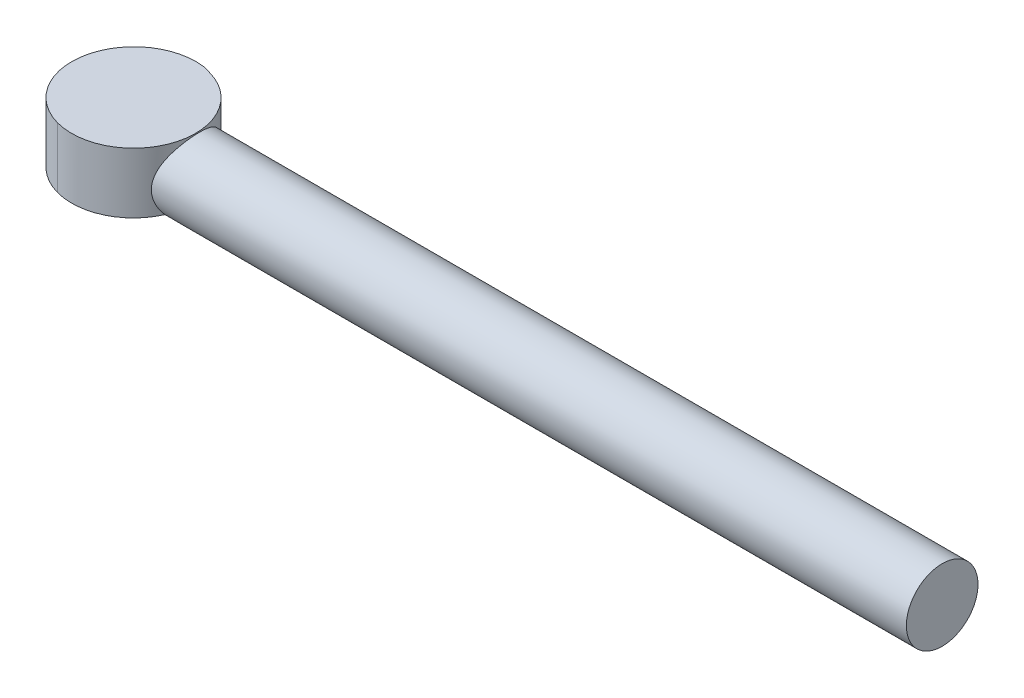
ISO-10303-21;
HEADER;
FILE_DESCRIPTION(('STEP AP214'),'2;1');
FILE_NAME('part.step','',(''),(''),'','','');
FILE_SCHEMA(('AUTOMOTIVE_DESIGN { 1 0 10303 214 1 1 1 1 }'));
ENDSEC;
DATA;
#1=APPLICATION_CONTEXT('core data for automotive mechanical design processes');
#2=APPLICATION_PROTOCOL_DEFINITION('international standard','automotive_design',2000,#1);
#3=PRODUCT_CONTEXT('',#1,'mechanical');
#4=PRODUCT('Part','Part','',(#3));
#5=PRODUCT_RELATED_PRODUCT_CATEGORY('part','',(#4));
#6=PRODUCT_DEFINITION_FORMATION('','',#4);
#7=PRODUCT_DEFINITION_CONTEXT('part definition',#1,'design');
#8=PRODUCT_DEFINITION('design','',#6,#7);
#9=PRODUCT_DEFINITION_SHAPE('','',#8);
#10=(LENGTH_UNIT() NAMED_UNIT(*) SI_UNIT(.MILLI.,.METRE.));
#11=(NAMED_UNIT(*) PLANE_ANGLE_UNIT() SI_UNIT($,.RADIAN.));
#12=(NAMED_UNIT(*) SI_UNIT($,.STERADIAN.) SOLID_ANGLE_UNIT());
#13=UNCERTAINTY_MEASURE_WITH_UNIT(LENGTH_MEASURE(1.E-05),#10,'distance_accuracy_value','');
#14=(GEOMETRIC_REPRESENTATION_CONTEXT(3) GLOBAL_UNCERTAINTY_ASSIGNED_CONTEXT((#13)) GLOBAL_UNIT_ASSIGNED_CONTEXT((#10,
#11,#12)) REPRESENTATION_CONTEXT('',''));
#15=CARTESIAN_POINT('',(0.,0.,0.));
#16=DIRECTION('',(0.,0.,1.));
#17=DIRECTION('',(1.,0.,0.));
#18=AXIS2_PLACEMENT_3D('',#15,#16,#17);
#19=CARTESIAN_POINT('',(96.8545760170194,56.3914355366215,55.1659043838348));
#20=DIRECTION('',(0.,-1.,0.));
#21=DIRECTION('',(0.,0.,-1.));
#22=AXIS2_PLACEMENT_3D('',#19,#20,#21);
#23=PLANE('',#22);
#24=CARTESIAN_POINT('',(96.8541225803506,56.3914355366215,55.167567362771));
#25=DIRECTION('',(0.,1.,0.));
#26=DIRECTION('',(0.,0.,1.));
#27=AXIS2_PLACEMENT_3D('',#24,#25,#26);
#28=CIRCLE('',#27,0.00172368899597669);
#29=CARTESIAN_POINT('',(96.8541225803506,56.3914355366215,55.169291051767));
#30=VERTEX_POINT('',#29);
#31=EDGE_CURVE('E248',#30,#30,#28,.T.);
#32=ORIENTED_EDGE('',*,*,#31,.F.);
#33=EDGE_LOOP('',(#32));
#34=FACE_BOUND('',#33,.T.);
#35=ADVANCED_FACE('F49',(#34),#23,.T.);
#36=CARTESIAN_POINT('',(96.8545760170194,56.3914355366215,55.1659043838348));
#37=DIRECTION('',(0.,-1.,0.));
#38=DIRECTION('',(0.,0.,-1.));
#39=AXIS2_PLACEMENT_3D('',#36,#37,#38);
#40=CYLINDRICAL_SURFACE('',#39,3.46216045673487);
#41=CARTESIAN_POINT('',(96.8545760170194,56.3914355366215,55.1659043838348));
#42=DIRECTION('',(0.,-1.,0.));
#43=DIRECTION('',(0.,0.,-1.));
#44=AXIS2_PLACEMENT_3D('',#41,#42,#43);
#45=CIRCLE('',#44,3.46216045673487);
#46=CARTESIAN_POINT('',(97.7653380559085,56.3914355366215,51.8256846999372));
#47=VERTEX_POINT('',#46);
#48=EDGE_CURVE('E183',#47,#47,#45,.T.);
#49=ORIENTED_EDGE('',*,*,#48,.F.);
#50=EDGE_LOOP('',(#49));
#51=FACE_BOUND('',#50,.T.);
#52=CARTESIAN_POINT('',(96.8541225803506,52.7701991631346,58.6314515085018));
#53=CARTESIAN_POINT('',(96.9112620064534,52.7701991631346,58.6314559256041));
#54=CARTESIAN_POINT('',(96.9684043444901,52.7701991631346,58.6300902903348));
#55=CARTESIAN_POINT('',(97.0821485067964,52.7701991631346,58.6245925534005));
#56=CARTESIAN_POINT('',(97.1387512876547,52.7701991631346,58.6204801677707));
#57=CARTESIAN_POINT('',(97.2514170575452,52.7701991631346,58.6094899818808));
#58=CARTESIAN_POINT('',(97.3074813334975,52.7701991631346,58.6026254247951));
#59=CARTESIAN_POINT('',(97.419069435874,52.7701991631346,58.5861389727258));
#60=CARTESIAN_POINT('',(97.4745942184117,52.7701991631346,58.5765235519419));
#61=CARTESIAN_POINT('',(97.5851038909195,52.7701991631346,58.5545418339806));
#62=CARTESIAN_POINT('',(97.6400887116757,52.7701991631346,58.5421751888272));
#63=CARTESIAN_POINT('',(97.7495196178963,52.7701991631346,58.5146981423592));
#64=CARTESIAN_POINT('',(97.8039639377698,52.7701991631346,58.4995807130437));
#65=CARTESIAN_POINT('',(97.9123155402251,52.7701991631346,58.4666081294795));
#66=CARTESIAN_POINT('',(97.9662187495785,52.7701991631346,58.4487396002146));
#67=CARTESIAN_POINT('',(98.0734910305163,52.7701991631346,58.4102732973724));
#68=CARTESIAN_POINT('',(98.1268532093883,52.7701991631346,58.3896563274302));
#69=CARTESIAN_POINT('',(98.2324667465263,52.7701991631346,58.3459296145232));
#70=CARTESIAN_POINT('',(98.2847194340027,52.7701991631346,58.3228230824743));
#71=CARTESIAN_POINT('',(98.3876711797754,52.7701991631346,58.2742500509742));
#72=CARTESIAN_POINT('',(98.4383785460453,52.7701991631346,58.24880118052));
#73=CARTESIAN_POINT('',(98.538241782558,52.7701991631346,58.195551838598));
#74=CARTESIAN_POINT('',(98.5874037577123,52.7701991631346,58.1677628209074));
#75=CARTESIAN_POINT('',(98.684178445602,52.7701991631346,58.1098388910631));
#76=CARTESIAN_POINT('',(98.7317943442887,52.7701991631346,58.079709303126));
#77=CARTESIAN_POINT('',(98.8254799571681,52.7701991631346,58.0171105292722));
#78=CARTESIAN_POINT('',(98.8715492771248,52.7701991631346,57.9846407533606));
#79=CARTESIAN_POINT('',(98.9621455510482,52.7701991631346,57.9173676187104));
#80=CARTESIAN_POINT('',(99.0066679689467,52.7701991631346,57.8825581528587));
#81=CARTESIAN_POINT('',(99.094174251266,52.7701991631346,57.8106105023401));
#82=CARTESIAN_POINT('',(99.1371490051695,52.7701991631346,57.7734612419675));
#83=CARTESIAN_POINT('',(99.2215662186495,52.7701991631346,57.6968410350278));
#84=CARTESIAN_POINT('',(99.2629947305358,52.7701991631346,57.6573547345584));
#85=CARTESIAN_POINT('',(99.3438528381099,52.7701991631346,57.5765214364688));
#86=CARTESIAN_POINT('',(99.3832857462363,52.7701991631346,57.5351777526927));
#87=CARTESIAN_POINT('',(99.4598128126185,52.7701991631346,57.4509043452251));
#88=CARTESIAN_POINT('',(99.4969213945965,52.7701991631346,57.4079877311046));
#89=CARTESIAN_POINT('',(99.5688053140424,52.7701991631346,57.3205757081029));
#90=CARTESIAN_POINT('',(99.6035906745621,52.7701991631346,57.2760885445628));
#91=CARTESIAN_POINT('',(99.6708323103181,52.7701991631346,57.1855397522172));
#92=CARTESIAN_POINT('',(99.70329356652,52.7701991631346,57.1394818231766));
#93=CARTESIAN_POINT('',(99.7658922702614,52.7701991631346,57.0457961625126));
#94=CARTESIAN_POINT('',(99.7960291277943,52.7701991631346,56.998168036674));
#95=CARTESIAN_POINT('',(99.8539848576856,52.7701991631346,56.9013460721814));
#96=CARTESIAN_POINT('',(99.8817972021687,52.7701991631346,56.8521483271651));
#97=CARTESIAN_POINT('',(99.9351092913124,52.7701991631346,56.7521901607608));
#98=CARTESIAN_POINT('',(99.960596380465,52.7701991631346,56.701422993201));
#99=CARTESIAN_POINT('',(100.009266432467,52.7701991631346,56.5983300832824));
#100=CARTESIAN_POINT('',(100.032430633645,52.7701991631346,56.5459954933168));
#101=CARTESIAN_POINT('',(100.076200220294,52.7701991631346,56.4403722055096));
#102=CARTESIAN_POINT('',(100.096809934211,52.7701991631346,56.3870853016451));
#103=CARTESIAN_POINT('',(100.135261687702,52.7701991631346,56.2799411849219));
#104=CARTESIAN_POINT('',(100.153122069873,52.7701991631346,56.2260905640079));
#105=CARTESIAN_POINT('',(100.186083018773,52.7701991631346,56.117823600034));
#106=CARTESIAN_POINT('',(100.201196000949,52.7701991631346,56.0634110390203));
#107=CARTESIAN_POINT('',(100.228667649306,52.7701991631346,55.9540226031096));
#108=CARTESIAN_POINT('',(100.241032333137,52.7701991631346,55.8990482402167));
#109=CARTESIAN_POINT('',(100.263014044099,52.7701991631346,55.7885384890301));
#110=CARTESIAN_POINT('',(100.272630375275,52.7701991631346,55.7330029623146));
#111=CARTESIAN_POINT('',(100.289122326213,52.7701991631346,55.6213724333826));
#112=CARTESIAN_POINT('',(100.295990420104,52.7701991631346,55.5652763202677));
#113=CARTESIAN_POINT('',(100.306992033887,52.7701991631346,55.45252536296));
#114=CARTESIAN_POINT('',(100.311111279965,52.7701991631346,55.3958691291704));
#115=CARTESIAN_POINT('',(100.316624596235,52.7701991631346,55.2819984771971));
#116=CARTESIAN_POINT('',(100.317997947072,52.7701991631346,55.224783064671));
#117=CARTESIAN_POINT('',(100.318015490006,52.7701991631346,55.1104499752584));
#118=CARTESIAN_POINT('',(100.316664367594,52.7701991631346,55.0533322993655));
#119=CARTESIAN_POINT('',(100.311186877288,52.7701991631346,54.93962919389));
#120=CARTESIAN_POINT('',(100.307079978372,52.7701991631346,54.8830428350618));
#121=CARTESIAN_POINT('',(100.296099951048,52.7701991631346,54.7704035939406));
#122=CARTESIAN_POINT('',(100.289239740342,52.7701991631346,54.7143494546163));
#123=CARTESIAN_POINT('',(100.272759091868,52.7701991631346,54.6027747728993));
#124=CARTESIAN_POINT('',(100.263144792302,52.7701991631346,54.5472533245609));
#125=CARTESIAN_POINT('',(100.241162994256,52.7701991631346,54.4367435906964));
#126=CARTESIAN_POINT('',(100.228794799825,52.7701991631346,54.3817554436156));
#127=CARTESIAN_POINT('',(100.20131222178,52.7701991631346,54.2723110863405));
#128=CARTESIAN_POINT('',(100.186190460044,52.7701991631346,54.2178567298359));
#129=CARTESIAN_POINT('',(100.153206702498,52.7701991631346,54.1094782927842));
#130=CARTESIAN_POINT('',(100.135330987627,52.7701991631346,54.0555583907687));
#131=CARTESIAN_POINT('',(100.096848215743,52.7701991631346,53.9482457712625));
#132=CARTESIAN_POINT('',(100.076221636022,52.7701991631346,53.8948600640733));
#133=CARTESIAN_POINT('',(100.032484464492,52.7701991631346,53.7892233494854));
#134=CARTESIAN_POINT('',(100.00937820189,52.7701991631346,53.7369705499456));
#135=CARTESIAN_POINT('',(99.960805366033,52.7701991631346,53.6340187228048));
#136=CARTESIAN_POINT('',(99.9353564241618,52.7701991631346,53.5833113862374));
#137=CARTESIAN_POINT('',(99.8821070302389,52.7701991631346,53.483448171352));
#138=CARTESIAN_POINT('',(99.854318031545,52.7701991631346,53.4342861882971));
#139=CARTESIAN_POINT('',(99.7963941155727,52.7701991631346,53.337511494638));
#140=CARTESIAN_POINT('',(99.7662645225642,52.7701991631346,53.2898955980605));
#141=CARTESIAN_POINT('',(99.7036657449962,52.7701991631346,53.1962099867259));
#142=CARTESIAN_POINT('',(99.6711959704435,52.7701991631346,53.150140666204));
#143=CARTESIAN_POINT('',(99.6039228367913,52.7701991631346,53.0595443918654));
#144=CARTESIAN_POINT('',(99.569113370574,52.7701991631346,53.015021974119));
#145=CARTESIAN_POINT('',(99.4971657197859,52.7701991631346,52.9275156919116));
#146=CARTESIAN_POINT('',(99.4600164595117,52.7701991631346,52.8845409379672));
#147=CARTESIAN_POINT('',(99.3833962526445,52.7701991631346,52.8001237244568));
#148=CARTESIAN_POINT('',(99.343909952148,52.7701991631346,52.7586952125817));
#149=CARTESIAN_POINT('',(99.2630766540378,52.7701991631346,52.6778371050151));
#150=CARTESIAN_POINT('',(99.2217329702679,52.7701991631346,52.6384041968851));
#151=CARTESIAN_POINT('',(99.137459562804,52.7701991631346,52.5618771304997));
#152=CARTESIAN_POINT('',(99.0945429486809,52.7701991631346,52.524768548522));
#153=CARTESIAN_POINT('',(99.0071309256768,52.7701991631346,52.4528846290759));
#154=CARTESIAN_POINT('',(98.9626437621368,52.7701991631346,52.4180992685558));
#155=CARTESIAN_POINT('',(98.8720949697912,52.7701991631346,52.3508576327992));
#156=CARTESIAN_POINT('',(98.8260370407502,52.7701991631346,52.3183963765973));
#157=CARTESIAN_POINT('',(98.7323513800862,52.7701991631346,52.255797672856));
#158=CARTESIAN_POINT('',(98.6847232542478,52.7701991631346,52.2256608153231));
#159=CARTESIAN_POINT('',(98.5879012897556,52.7701991631346,52.1677050854321));
#160=CARTESIAN_POINT('',(98.5387035447397,52.7701991631346,52.1398927409493));
#161=CARTESIAN_POINT('',(98.4387453783365,52.7701991631346,52.0865806518064));
#162=CARTESIAN_POINT('',(98.3879782107773,52.7701991631346,52.0610935626542));
#163=CARTESIAN_POINT('',(98.2848853008602,52.7701991631346,52.0124235106536));
#164=CARTESIAN_POINT('',(98.2325507108955,52.7701991631346,51.9892593094755));
#165=CARTESIAN_POINT('',(98.1269274230885,52.7701991631346,51.9454897228279));
#166=CARTESIAN_POINT('',(98.0736405192234,52.7701991631346,51.9248800089108));
#167=CARTESIAN_POINT('',(97.9664964024991,52.7701991631346,51.8864282554198));
#168=CARTESIAN_POINT('',(97.9126457815846,52.7701991631346,51.8685678732482));
#169=CARTESIAN_POINT('',(97.8043788176101,52.7701991631346,51.8356069243485));
#170=CARTESIAN_POINT('',(97.7499662565961,52.7701991631346,51.8204939421726));
#171=CARTESIAN_POINT('',(97.6405778206851,52.7701991631346,51.793022293816));
#172=CARTESIAN_POINT('',(97.5856034577921,52.7701991631346,51.7806576099844));
#173=CARTESIAN_POINT('',(97.4750937066054,52.7701991631346,51.7586758990224));
#174=CARTESIAN_POINT('',(97.4195581798901,52.7701991631346,51.7490595678465));
#175=CARTESIAN_POINT('',(97.3079276509584,52.7701991631346,51.7325676169086));
#176=CARTESIAN_POINT('',(97.2518315378438,52.7701991631346,51.7256995230171));
#177=CARTESIAN_POINT('',(97.1390805805368,52.7701991631346,51.7146979092346));
#178=CARTESIAN_POINT('',(97.0824243467476,52.7701991631346,51.7105786631566));
#179=CARTESIAN_POINT('',(96.9685536947755,52.7701991631346,51.7050653468864));
#180=CARTESIAN_POINT('',(96.91133828225,52.7701991631346,51.70369199605));
#181=CARTESIAN_POINT('',(96.7970051928373,52.7701991631346,51.7036744531153));
#182=CARTESIAN_POINT('',(96.7398875169438,52.7701991631346,51.7050255755276));
#183=CARTESIAN_POINT('',(96.6261844114672,52.7701991631346,51.7105030658337));
#184=CARTESIAN_POINT('',(96.5695980526387,52.7701991631346,51.7146099647491));
#185=CARTESIAN_POINT('',(96.4569588115167,52.7701991631346,51.725589992074));
#186=CARTESIAN_POINT('',(96.4009046721921,52.7701991631346,51.7324502027791));
#187=CARTESIAN_POINT('',(96.2893299904747,52.7701991631346,51.7489308512534));
#188=CARTESIAN_POINT('',(96.2338085421363,52.7701991631346,51.7585451508195));
#189=CARTESIAN_POINT('',(96.1232988082718,52.7701991631346,51.780526948866));
#190=CARTESIAN_POINT('',(96.0683106611911,52.7701991631346,51.7928951432964));
#191=CARTESIAN_POINT('',(95.9588663039163,52.7701991631346,51.820377721342));
#192=CARTESIAN_POINT('',(95.9044119474119,52.7701991631346,51.8354994830773));
#193=CARTESIAN_POINT('',(95.796033510361,52.7701991631346,51.8684832406238));
#194=CARTESIAN_POINT('',(95.7421136083459,52.7701991631346,51.8863589554944));
#195=CARTESIAN_POINT('',(95.6348009888408,52.7701991631346,51.9248417273785));
#196=CARTESIAN_POINT('',(95.5814152816522,52.7701991631346,51.9454683070994));
#197=CARTESIAN_POINT('',(95.475778567065,52.7701991631346,51.9892054786302));
#198=CARTESIAN_POINT('',(95.4235257675252,52.7701991631346,52.0123117412322));
#199=CARTESIAN_POINT('',(95.3205739403844,52.7701991631346,52.0608845770895));
#200=CARTESIAN_POINT('',(95.269866603817,52.7701991631346,52.0863335189609));
#201=CARTESIAN_POINT('',(95.1700033889316,52.7701991631346,52.1395829128841));
#202=CARTESIAN_POINT('',(95.1208414058766,52.7701991631346,52.1673719115781));
#203=CARTESIAN_POINT('',(95.0240667122176,52.7701991631346,52.2252958275506));
#204=CARTESIAN_POINT('',(94.9764508156401,52.7701991631346,52.2554254205591));
#205=CARTESIAN_POINT('',(94.8827652043055,52.7701991631346,52.3180241981271));
#206=CARTESIAN_POINT('',(94.8366958837836,52.7701991631346,52.3504939726797));
#207=CARTESIAN_POINT('',(94.746099609445,52.7701991631346,52.4177671063318));
#208=CARTESIAN_POINT('',(94.7015771916986,52.7701991631346,52.452576572549));
#209=CARTESIAN_POINT('',(94.6140709094912,52.7701991631346,52.5245242233368));
#210=CARTESIAN_POINT('',(94.5710961555468,52.7701991631346,52.5616734836108));
#211=CARTESIAN_POINT('',(94.4866789420364,52.7701991631346,52.6382936904776));
#212=CARTESIAN_POINT('',(94.4452504301612,52.7701991631346,52.6777799909738));
#213=CARTESIAN_POINT('',(94.3643923225953,52.7701991631346,52.7586132890829));
#214=CARTESIAN_POINT('',(94.3249594144659,52.7701991631346,52.7999569728519));
#215=CARTESIAN_POINT('',(94.2484323480816,52.7701991631346,52.8842303803142));
#216=CARTESIAN_POINT('',(94.2113237661044,52.7701991631346,52.9271469944367));
#217=CARTESIAN_POINT('',(94.139439846659,52.7701991631346,53.0145590174398));
#218=CARTESIAN_POINT('',(94.1046544861391,52.7701991631346,53.0590461809794));
#219=CARTESIAN_POINT('',(94.0374128503829,52.7701991631346,53.1495949733245));
#220=CARTESIAN_POINT('',(94.0049515941811,52.7701991631346,53.1956529023654));
#221=CARTESIAN_POINT('',(93.9423528904398,52.7701991631346,53.2893385630294));
#222=CARTESIAN_POINT('',(93.9122160329068,52.7701991631346,53.3369666888679));
#223=CARTESIAN_POINT('',(93.8542603030155,52.7701991631346,53.4337886533606));
#224=CARTESIAN_POINT('',(93.8264479585324,52.7701991631346,53.4829863983769));
#225=CARTESIAN_POINT('',(93.7731358693888,52.7701991631346,53.5829445647811));
#226=CARTESIAN_POINT('',(93.7476487802362,52.7701991631346,53.633711732341));
#227=CARTESIAN_POINT('',(93.6989787282344,52.7701991631346,53.7368046422596));
#228=CARTESIAN_POINT('',(93.6758145270557,52.7701991631346,53.7891392322252));
#229=CARTESIAN_POINT('',(93.6320449404074,52.7701991631346,53.8947625200324));
#230=CARTESIAN_POINT('',(93.6114352264904,52.7701991631346,53.9480494238969));
#231=CARTESIAN_POINT('',(93.5729834729993,52.7701991631346,54.05519354062));
#232=CARTESIAN_POINT('',(93.5551230908278,52.7701991631346,54.1090441615341));
#233=CARTESIAN_POINT('',(93.5221621419281,52.7701991631346,54.2173111255079));
#234=CARTESIAN_POINT('',(93.5070491597522,52.7701991631346,54.2717236865217));
#235=CARTESIAN_POINT('',(93.4795775113955,52.7701991631346,54.3811121224323));
#236=CARTESIAN_POINT('',(93.467212827564,52.7701991631346,54.4360864853253));
#237=CARTESIAN_POINT('',(93.4452311166019,52.7701991631346,54.5465962365119));
#238=CARTESIAN_POINT('',(93.4356147854261,52.7701991631346,54.6021317632273));
#239=CARTESIAN_POINT('',(93.4191228344882,52.7701991631346,54.7137622921593));
#240=CARTESIAN_POINT('',(93.4122547405966,52.7701991631346,54.7698584052743));
#241=CARTESIAN_POINT('',(93.4012531268141,52.7701991631346,54.8826093625819));
#242=CARTESIAN_POINT('',(93.3971338807361,52.7701991631346,54.9392655963716));
#243=CARTESIAN_POINT('',(93.3916205644659,52.7701991631346,55.0531362483448));
#244=CARTESIAN_POINT('',(93.3902472136296,52.7701991631346,55.110351660871));
#245=CARTESIAN_POINT('',(93.3902296706949,52.7701991631346,55.2246847502838));
#246=CARTESIAN_POINT('',(93.3915807931072,52.7701991631346,55.281802426177));
#247=CARTESIAN_POINT('',(93.3970582834133,52.7701991631346,55.395505531653));
#248=CARTESIAN_POINT('',(93.4011651823287,52.7701991631346,55.4520918904813));
#249=CARTESIAN_POINT('',(93.4121452096536,52.7701991631346,55.5647311316028));
#250=CARTESIAN_POINT('',(93.4190054203587,52.7701991631346,55.6207852709273));
#251=CARTESIAN_POINT('',(93.435486068833,52.7701991631346,55.7323599526444));
#252=CARTESIAN_POINT('',(93.4451003683991,52.7701991631346,55.7878814009828));
#253=CARTESIAN_POINT('',(93.4670821664456,52.7701991631346,55.8983911348473));
#254=CARTESIAN_POINT('',(93.479450360876,52.7701991631346,55.953379281928));
#255=CARTESIAN_POINT('',(93.5069329389216,52.7701991631346,56.062823639203));
#256=CARTESIAN_POINT('',(93.5220547006569,52.7701991631346,56.1172779957076));
#257=CARTESIAN_POINT('',(93.5550384582034,52.7701991631346,56.225656432759));
#258=CARTESIAN_POINT('',(93.572914173074,52.7701991631346,56.2795763347742));
#259=CARTESIAN_POINT('',(93.6113969449581,52.7701991631346,56.38688895428));
#260=CARTESIAN_POINT('',(93.6320235246789,52.7701991631346,56.440274661469));
#261=CARTESIAN_POINT('',(93.6757606962097,52.7701991631346,56.5459113760567));
#262=CARTESIAN_POINT('',(93.6988669588117,52.7701991631346,56.5981641755967));
#263=CARTESIAN_POINT('',(93.7474397946688,52.7701991631346,56.7011160027379));
#264=CARTESIAN_POINT('',(93.7728887365402,52.7701991631346,56.7518233393053));
#265=CARTESIAN_POINT('',(93.8261381304632,52.7701991631346,56.851686554191));
#266=CARTESIAN_POINT('',(93.8539271291572,52.7701991631346,56.900848537246));
#267=CARTESIAN_POINT('',(93.9118510451297,52.7701991631346,56.9976232309051));
#268=CARTESIAN_POINT('',(93.9419806381382,52.7701991631346,57.0452391274826));
#269=CARTESIAN_POINT('',(94.0045794157061,52.7701991631346,57.1389247388174));
#270=CARTESIAN_POINT('',(94.0370491902587,52.7701991631346,57.1849940593394));
#271=CARTESIAN_POINT('',(94.104322323911,52.7701991631346,57.2755903336774));
#272=CARTESIAN_POINT('',(94.1391317901284,52.7701991631346,57.3201127514233));
#273=CARTESIAN_POINT('',(94.2110794409157,52.7701991631346,57.4076190336319));
#274=CARTESIAN_POINT('',(94.248228701189,52.7701991631346,57.4505937875781));
#275=CARTESIAN_POINT('',(94.3248489080581,52.7701991631346,57.5350110010829));
#276=CARTESIAN_POINT('',(94.3643352085574,52.7701991631346,57.5764395129507));
#277=CARTESIAN_POINT('',(94.4451685066588,52.7701991631346,57.6572976205362));
#278=CARTESIAN_POINT('',(94.4865121904171,52.7701991631346,57.6967305286926));
#279=CARTESIAN_POINT('',(94.5707855979106,52.7701991631346,57.7732575950043));
#280=CARTESIAN_POINT('',(94.6137022120746,52.7701991631346,57.8103661768828));
#281=CARTESIAN_POINT('',(94.7011142349658,52.7701991631346,57.8822500965981));
#282=CARTESIAN_POINT('',(94.7456013983528,52.7701991631346,57.9170354574844));
#283=CARTESIAN_POINT('',(94.8361501911154,52.7701991631346,57.98427709224));
#284=CARTESIAN_POINT('',(94.8822081207246,52.7701991631346,58.0167383470786));
#285=CARTESIAN_POINT('',(94.9758937798351,52.7701991631346,58.0793370545465));
#286=CARTESIAN_POINT('',(95.0235219035511,52.7701991631346,58.1094739171709));
#287=CARTESIAN_POINT('',(95.12034387385,52.7701991631346,58.1674296331333));
#288=CARTESIAN_POINT('',(95.1695416268226,52.7701991631346,58.1952419585305));
#289=CARTESIAN_POINT('',(95.2694997714431,52.7701991631346,58.2485540999276));
#290=CARTESIAN_POINT('',(95.3202669090685,52.7701991631346,58.2740412608861));
#291=CARTESIAN_POINT('',(95.4233599010009,52.7701991631346,58.3227111161507));
#292=CARTESIAN_POINT('',(95.475694603983,52.7701991631346,58.3458750462237));
#293=CARTESIAN_POINT('',(95.5813410878129,52.7701991631346,58.3896551120619));
#294=CARTESIAN_POINT('',(95.6346515393235,52.7701991631346,58.4102744552163));
#295=CARTESIAN_POINT('',(95.7418360297163,52.7701991631346,58.4487427118364));
#296=CARTESIAN_POINT('',(95.7957033582361,52.7701991631346,58.4666102962598));
#297=CARTESIAN_POINT('',(95.9039971771703,52.7701991631346,58.4995824345671));
#298=CARTESIAN_POINT('',(95.9584197799861,52.7701991631346,58.5146997488994));
#299=CARTESIAN_POINT('',(96.0678216878525,52.7701991631346,58.5421769635076));
#300=CARTESIAN_POINT('',(96.1227993926237,52.7701991631346,58.5545432320308));
#301=CARTESIAN_POINT('',(96.2333091707381,52.7701991631346,58.576524934251));
#302=CARTESIAN_POINT('',(96.2888413132934,52.7701991631346,58.5861400199516));
#303=CARTESIAN_POINT('',(96.4004585393771,52.7701991631346,58.6026264885195));
#304=CARTESIAN_POINT('',(96.4565446842552,52.7701991631346,58.6094906822669));
#305=CARTESIAN_POINT('',(96.569268605625,52.7701991631346,58.6204808708528));
#306=CARTESIAN_POINT('',(96.6259077377345,52.7701991631346,58.6245929059439));
#307=CARTESIAN_POINT('',(96.7397391211677,52.7701991631346,58.6300906278827));
#308=CARTESIAN_POINT('',(96.7969323624189,52.7701991631346,58.6314558989968));
#309=CARTESIAN_POINT('',(96.8541225803506,52.7701991631346,58.6314515085018));
#310=B_SPLINE_CURVE_WITH_KNOTS('',3,(#52,#53,#54,#55,#56,#57,#58,#59,#60,#61,#62,#63,#64,#65,
#66,#67,#68,#69,#70,#71,#72,#73,#74,#75,#76,#77,#78,#79,#80,#81,#82,#83,#84,#85,#86,#87,#88,#89,
#90,#91,#92,#93,#94,#95,#96,#97,#98,#99,#100,#101,#102,#103,#104,#105,#106,#107,#108,#109,#110,
#111,#112,#113,#114,#115,#116,#117,#118,#119,#120,#121,#122,#123,#124,#125,#126,#127,#128,#129,
#130,#131,#132,#133,#134,#135,#136,#137,#138,#139,#140,#141,#142,#143,#144,#145,#146,#147,#148,
#149,#150,#151,#152,#153,#154,#155,#156,#157,#158,#159,#160,#161,#162,#163,#164,#165,#166,#167,
#168,#169,#170,#171,#172,#173,#174,#175,#176,#177,#178,#179,#180,#181,#182,#183,#184,#185,#186,
#187,#188,#189,#190,#191,#192,#193,#194,#195,#196,#197,#198,#199,#200,#201,#202,#203,#204,#205,
#206,#207,#208,#209,#210,#211,#212,#213,#214,#215,#216,#217,#218,#219,#220,#221,#222,#223,#224,
#225,#226,#227,#228,#229,#230,#231,#232,#233,#234,#235,#236,#237,#238,#239,#240,#241,#242,#243,
#244,#245,#246,#247,#248,#249,#250,#251,#252,#253,#254,#255,#256,#257,#258,#259,#260,#261,#262,
#263,#264,#265,#266,#267,#268,#269,#270,#271,#272,#273,#274,#275,#276,#277,#278,#279,#280,#281,
#282,#283,#284,#285,#286,#287,#288,#289,#290,#291,#292,#293,#294,#295,#296,#297,#298,#299,#300,
#301,#302,#303,#304,#305,#306,#307,#308,#309),.UNSPECIFIED.,.F.,.F.,(4,2,2,2,2,2,2,2,2,2,2,2,2,
2,2,2,2,2,2,2,2,2,2,2,2,2,2,2,2,2,2,2,2,2,2,2,2,2,2,2,2,2,2,2,2,2,2,2,2,2,2,2,2,2,2,2,2,2,2,2,2,
2,2,2,2,2,2,2,2,2,2,2,2,2,2,2,2,2,2,2,2,2,2,2,2,2,2,2,2,2,2,2,2,2,2,2,2,2,2,2,2,2,2,2,2,2,2,2,2,
2,2,2,2,2,2,2,2,2,2,2,2,2,2,2,2,2,2,2,4),(0.,0.171406034270473,0.341594760706496,
0.51097420050286,0.679958237156577,0.848963659140802,1.01840709712112,1.18870196694212,
1.36025552912706,1.53159042017547,1.70172743527465,1.87107537987785,2.04004878664351,
2.20906494405116,2.37854082479497,2.54889002573565,2.72051983021772,2.89185472126497,
3.06199173636329,3.23133968096596,3.40031308773144,3.56932924513927,3.73880512588364,
3.90915432682524,4.08078413130861,4.2521190223576,4.42225603745718,4.5916039820606,
4.76057738882633,4.92959354623392,5.09906942697754,5.26941862791793,5.44104843239962,
5.61238332344792,5.78252033854701,5.95186828315016,6.12084168991581,6.28985784732347,
6.45933372806734,6.62968292900809,6.80131273349024,6.97264762453834,7.14278463963727,
7.3121325842403,7.48110599100591,7.65012214841362,7.81959802915763,7.98994723009867,
8.16157703458128,8.33291192563175,8.50304894073239,8.67239688533646,8.84137029210241,
9.01038644950978,9.17986233025274,9.35021153119205,9.52184133567222,9.69317622672298,
9.86331324182382,10.032661186428,10.201634593194,10.3706507506013,10.5401266313442,
10.7104758322832,10.882105636763,11.0534405278132,11.2235775429136,11.3929254875176,
11.5618988942835,11.7309150516909,11.900390932434,12.0707401333735,12.2423699378539,
12.4137048289023,12.5838418440015,12.7531897886047,12.9221631953703,13.091179352778,
13.2606552335218,13.4310044344625,13.6026342389445,13.7739691299918,13.9441061450901,
14.1134540896928,14.2824274964583,14.4514436538661,14.6209195346104,14.791268735552,
14.9628985400354,15.1342334310844,15.304370446184,15.4737183907874,15.6426917975531,
15.8117079549607,15.9811838357044,16.1515330366447,16.3231628411264,16.4944977321755,
16.6646347472752,16.8339826918786,17.0029560986444,17.1719722560519,17.3414481367955,
17.5117973377357,17.6834271422171,17.854762033266,18.0248990483654,18.1942469929688,
18.3632203997345,18.5322365571421,18.7017124378858,18.8720616388263,19.0436914433081,
19.2150263343567,19.385163349456,19.5545112940592,19.7234847008249,19.8925008582325,
20.0619767389763,20.2323259399169,20.4039557443988,20.5753669548362,20.7455583552642,
20.9149387742716,21.0839229266467,21.2529284443442,21.4223728013403,21.5926702442772,
21.7642288403056),.UNSPECIFIED.);
#311=CARTESIAN_POINT('',(96.8541225803506,52.7701991631346,58.6314515085018));
#312=VERTEX_POINT('',#311);
#313=EDGE_CURVE('E295',#312,#312,#310,.T.);
#314=ORIENTED_EDGE('',*,*,#313,.F.);
#315=EDGE_LOOP('',(#314));
#316=FACE_BOUND('',#315,.T.);
#317=ADVANCED_FACE('F227',(#51,#316),#40,.F.);
#318=CARTESIAN_POINT('',(96.8545760170194,56.6564158842198,55.1659043838348));
#319=DIRECTION('',(0.,1.,0.));
#320=DIRECTION('',(0.,0.,1.));
#321=AXIS2_PLACEMENT_3D('',#318,#319,#320);
#322=PLANE('',#321);
#323=CARTESIAN_POINT('',(96.8541225803506,56.6564158842198,55.167567362771));
#324=DIRECTION('',(0.,1.,0.));
#325=DIRECTION('',(0.,0.,1.));
#326=AXIS2_PLACEMENT_3D('',#323,#324,#325);
#327=CIRCLE('',#326,3.46388414573084);
#328=CARTESIAN_POINT('',(96.8541225803506,56.6564158842198,58.6314515085018));
#329=VERTEX_POINT('',#328);
#330=EDGE_CURVE('E148',#329,#329,#327,.T.);
#331=ORIENTED_EDGE('',*,*,#330,.F.);
#332=EDGE_LOOP('',(#331));
#333=FACE_BOUND('',#332,.T.);
#334=CARTESIAN_POINT('',(96.8541225803506,56.6564158842198,55.167567362771));
#335=DIRECTION('',(0.,1.,0.));
#336=DIRECTION('',(0.,0.,1.));
#337=AXIS2_PLACEMENT_3D('',#334,#335,#336);
#338=CIRCLE('',#337,0.00172368899597669);
#339=CARTESIAN_POINT('',(96.8541225803506,56.6564158842198,55.169291051767));
#340=VERTEX_POINT('',#339);
#341=EDGE_CURVE('E152',#340,#340,#338,.T.);
#342=ORIENTED_EDGE('',*,*,#341,.T.);
#343=EDGE_LOOP('',(#342));
#344=FACE_BOUND('',#343,.T.);
#345=ADVANCED_FACE('F244',(#333,#344),#322,.F.);
#346=CARTESIAN_POINT('',(96.8541225803506,57.4541363944663,55.167567362771));
#347=DIRECTION('',(0.,1.,0.));
#348=DIRECTION('',(0.,0.,1.));
#349=AXIS2_PLACEMENT_3D('',#346,#347,#348);
#350=CYLINDRICAL_SURFACE('',#349,0.00172368899597669);
#351=ORIENTED_EDGE('',*,*,#341,.F.);
#352=EDGE_LOOP('',(#351));
#353=FACE_BOUND('',#352,.T.);
#354=ORIENTED_EDGE('',*,*,#31,.T.);
#355=EDGE_LOOP('',(#354));
#356=FACE_BOUND('',#355,.T.);
#357=ADVANCED_FACE('F223',(#353,#356),#350,.T.);
#358=CARTESIAN_POINT('',(96.8541225803506,57.4541363944663,55.167567362771));
#359=DIRECTION('',(0.,1.,0.));
#360=DIRECTION('',(0.,0.,1.));
#361=AXIS2_PLACEMENT_3D('',#358,#359,#360);
#362=CYLINDRICAL_SURFACE('',#361,3.46388414573084);
#363=CARTESIAN_POINT('',(96.8541225803506,56.3914355366215,55.167567362771));
#364=DIRECTION('',(0.,1.,0.));
#365=DIRECTION('',(0.,0.,1.));
#366=AXIS2_PLACEMENT_3D('',#363,#364,#365);
#367=CIRCLE('',#366,3.46388414573084);
#368=EDGE_CURVE('E298',#47,#47,#367,.T.);
#369=ORIENTED_EDGE('',*,*,#368,.F.);
#370=EDGE_LOOP('',(#369));
#371=FACE_BOUND('',#370,.T.);
#372=ORIENTED_EDGE('',*,*,#330,.T.);
#373=EDGE_LOOP('',(#372));
#374=FACE_BOUND('',#373,.T.);
#375=ADVANCED_FACE('F219',(#371,#374),#362,.F.);
#376=CARTESIAN_POINT('',(96.8545760170194,56.3914355366215,55.1659043838348));
#377=DIRECTION('',(0.,1.,0.));
#378=DIRECTION('',(0.,0.,1.));
#379=AXIS2_PLACEMENT_3D('',#376,#377,#378);
#380=PLANE('',#379);
#381=ORIENTED_EDGE('',*,*,#368,.T.);
#382=ORIENTED_EDGE('',*,*,#48,.T.);
#383=EDGE_LOOP('',(#381,#382));
#384=FACE_BOUND('',#383,.T.);
#385=ADVANCED_FACE('F222',(#384),#380,.T.);
#386=CARTESIAN_POINT('',(148.964967413945,54.2919383485026,55.0676619565956));
#387=DIRECTION('',(1.,0.,0.));
#388=DIRECTION('',(0.,0.,-1.));
#389=AXIS2_PLACEMENT_3D('',#386,#387,#388);
#390=PLANE('',#389);
#391=CARTESIAN_POINT('',(148.964967413945,54.2919383485026,55.0676619565956));
#392=DIRECTION('',(1.,0.,0.));
#393=DIRECTION('',(0.,0.,-1.));
#394=AXIS2_PLACEMENT_3D('',#391,#392,#393);
#395=CIRCLE('',#394,2.31365217276674);
#396=CARTESIAN_POINT('',(148.964967413945,54.2919383485026,52.7540097838289));
#397=VERTEX_POINT('',#396);
#398=EDGE_CURVE('E297',#397,#397,#395,.T.);
#399=ORIENTED_EDGE('',*,*,#398,.T.);
#400=EDGE_LOOP('',(#399));
#401=FACE_BOUND('',#400,.T.);
#402=ADVANCED_FACE('F217',(#401),#390,.T.);
#403=CARTESIAN_POINT('',(96.8541225803506,57.4541363944663,55.167567362771));
#404=DIRECTION('',(0.,-1.,0.));
#405=DIRECTION('',(0.,0.,-1.));
#406=AXIS2_PLACEMENT_3D('',#403,#404,#405);
#407=CYLINDRICAL_SURFACE('',#406,4.41488839314275);
#408=CARTESIAN_POINT('',(96.8541225803506,52.7701991631346,55.167567362771));
#409=DIRECTION('',(0.,-1.,0.));
#410=DIRECTION('',(0.,0.,-1.));
#411=AXIS2_PLACEMENT_3D('',#408,#409,#410);
#412=CIRCLE('',#411,4.41488839314275);
#413=CARTESIAN_POINT('',(100.866071621606,52.7701991631346,53.3248779113784));
#414=VERTEX_POINT('',#413);
#415=CARTESIAN_POINT('',(100.951949968283,52.7701991631346,56.8104460018129));
#416=VERTEX_POINT('',#415);
#417=EDGE_CURVE('E198',#414,#416,#412,.T.);
#418=ORIENTED_EDGE('',*,*,#417,.F.);
#419=CARTESIAN_POINT('',(100.951949968283,52.7701991631346,56.8104460018129));
#420=CARTESIAN_POINT('',(100.968853025103,52.7219228459353,56.7682846617803));
#421=CARTESIAN_POINT('',(100.98579065885,52.6754209122313,56.7241512182095));
#422=CARTESIAN_POINT('',(101.019313049841,52.5861637223284,56.6320919683548));
#423=CARTESIAN_POINT('',(101.035897685309,52.5434097437049,56.5841648794331));
#424=CARTESIAN_POINT('',(101.084583223486,52.4208321077574,56.4346218506988));
#425=CARTESIAN_POINT('',(101.115492761164,52.3470301107758,56.3275383330305));
#426=CARTESIAN_POINT('',(101.170807418887,52.2176973411092,56.100902457328));
#427=CARTESIAN_POINT('',(101.195194228569,52.1622179025853,55.9813162827052));
#428=CARTESIAN_POINT('',(101.234411964979,52.0721815596385,55.7332459148897));
#429=CARTESIAN_POINT('',(101.249264965907,52.0375763351809,55.604783044611));
#430=CARTESIAN_POINT('',(101.266785625383,51.9926531894306,55.3529412222726));
#431=CARTESIAN_POINT('',(101.27028971198,51.9806967253358,55.2299122910808));
#432=CARTESIAN_POINT('',(101.266894990303,51.9765367660286,54.9836302346225));
#433=CARTESIAN_POINT('',(101.259994792971,51.9843359084479,54.8603770816149));
#434=CARTESIAN_POINT('',(101.23705047507,52.0180963068303,54.6250505980971));
#435=CARTESIAN_POINT('',(101.221588170084,52.0429237912999,54.5127532934309));
#436=CARTESIAN_POINT('',(101.183189603436,52.1084108526536,54.2942195900485));
#437=CARTESIAN_POINT('',(101.160250747979,52.149075924932,54.1879853097924));
#438=CARTESIAN_POINT('',(101.107238718469,52.2473804438809,53.9782028692415));
#439=CARTESIAN_POINT('',(101.076845394919,52.305822756146,53.875114994903));
#440=CARTESIAN_POINT('',(101.012091617876,52.4369541636912,53.6799186205619));
#441=CARTESIAN_POINT('',(100.977733825634,52.5096337244557,53.5878028387056));
#442=CARTESIAN_POINT('',(100.930032610892,52.6172692257222,53.4707061665741));
#443=CARTESIAN_POINT('',(100.917242698796,52.6467680094963,53.4403344091126));
#444=CARTESIAN_POINT('',(100.891645177204,52.7073194886682,53.3813197473459));
#445=CARTESIAN_POINT('',(100.878837648666,52.7383690960574,53.3526736397113));
#446=CARTESIAN_POINT('',(100.866071621606,52.7701991631346,53.3248779113784));
#447=B_SPLINE_CURVE_WITH_KNOTS('',3,(#419,#420,#421,#422,#423,#424,#425,#426,#427,#428,#429,
#430,#431,#432,#433,#434,#435,#436,#437,#438,#439,#440,#441,#442,#443,#444,#445,#446),
.UNSPECIFIED.,.F.,.F.,(4,2,2,2,2,2,2,2,2,2,2,2,2,4),(0.,0.198746322642264,0.397560131155452,
0.796564027129921,1.19667650861936,1.59585921179006,1.96485942895716,2.33390891507627,
2.68050697655425,3.02722540941497,3.39279986113569,3.75813032385048,3.89077198239731,
4.02315930678074),.UNSPECIFIED.);
#448=EDGE_CURVE('E173',#416,#414,#447,.T.);
#449=ORIENTED_EDGE('',*,*,#448,.F.);
#450=EDGE_LOOP('',(#418,#449));
#451=FACE_BOUND('',#450,.T.);
#452=ADVANCED_FACE('F213',(#451),#407,.F.);
#453=CARTESIAN_POINT('',(148.964967413945,54.2919383485026,55.0676619565956));
#454=DIRECTION('',(-1.,0.,0.));
#455=DIRECTION('',(0.,0.,1.));
#456=AXIS2_PLACEMENT_3D('',#453,#454,#455);
#457=CYLINDRICAL_SURFACE('',#456,2.31365217276674);
#458=ORIENTED_EDGE('',*,*,#398,.F.);
#459=EDGE_LOOP('',(#458));
#460=FACE_BOUND('',#459,.T.);
#461=CARTESIAN_POINT('',(100.504461340435,52.7701991631346,56.8104460018129));
#462=CARTESIAN_POINT('',(100.467990959163,52.8642756512396,56.8925871547212));
#463=CARTESIAN_POINT('',(100.431481480311,52.9651423115982,56.9672304901738));
#464=CARTESIAN_POINT('',(100.362244372967,53.1793958489115,57.1002142444792));
#465=CARTESIAN_POINT('',(100.329547798502,53.2928725677681,57.158425632986));
#466=CARTESIAN_POINT('',(100.272358442515,53.5303007912471,57.2561352811181));
#467=CARTESIAN_POINT('',(100.247901622887,53.6542953299582,57.2955518144832));
#468=CARTESIAN_POINT('',(100.211575326032,53.9085207182227,57.3530171938109));
#469=CARTESIAN_POINT('',(100.199655170156,54.0387242178218,57.3711521040805));
#470=CARTESIAN_POINT('',(100.191078573897,54.2860326219669,57.3842385113276));
#471=CARTESIAN_POINT('',(100.19285441258,54.4029614038392,57.3815707744361));
#472=CARTESIAN_POINT('',(100.207705190405,54.6344572722243,57.3587770467607));
#473=CARTESIAN_POINT('',(100.220791050346,54.749021966503,57.338634182167));
#474=CARTESIAN_POINT('',(100.255369530984,54.9666973803302,57.2834379990236));
#475=CARTESIAN_POINT('',(100.276398097947,55.070094237612,57.2491997214505));
#476=CARTESIAN_POINT('',(100.324399824251,55.2698790522383,57.1672537466547));
#477=CARTESIAN_POINT('',(100.351373938725,55.3662658801321,57.1195438849198));
#478=CARTESIAN_POINT('',(100.412664661682,55.5635157308109,57.0043754194163));
#479=CARTESIAN_POINT('',(100.447480849001,55.6631630284776,56.9351007162423));
#480=CARTESIAN_POINT('',(100.517931715698,55.8503466385807,56.7820099286486));
#481=CARTESIAN_POINT('',(100.553567070993,55.9378724980493,56.69818143236));
#482=CARTESIAN_POINT('',(100.626263022542,56.1084492049663,56.5069321248735));
#483=CARTESIAN_POINT('',(100.663022645254,56.1898511973582,56.3979110019111));
#484=CARTESIAN_POINT('',(100.729150889737,56.33302809976,56.1656229629419));
#485=CARTESIAN_POINT('',(100.758523431653,56.3948134244469,56.042363653692));
#486=CARTESIAN_POINT('',(100.804706002312,56.4929422142623,55.7925604092427));
#487=CARTESIAN_POINT('',(100.822160345238,56.5305823919751,55.6666499244981));
#488=CARTESIAN_POINT('',(100.844854371468,56.5839973942729,55.4092456807344));
#489=CARTESIAN_POINT('',(100.850106265109,56.5997940700658,55.2777576371917));
#490=CARTESIAN_POINT('',(100.847613081983,56.6081993851678,55.0299941374456));
#491=CARTESIAN_POINT('',(100.84134781083,56.6033561686145,54.9137807624046));
#492=CARTESIAN_POINT('',(100.819021642941,56.5765345999218,54.6843279603133));
#493=CARTESIAN_POINT('',(100.802960605388,56.5545560014551,54.5710885760394));
#494=CARTESIAN_POINT('',(100.762565422753,56.4950324271518,54.3520611929379));
#495=CARTESIAN_POINT('',(100.738344128487,56.4576983300646,54.246194133106));
#496=CARTESIAN_POINT('',(100.683349924605,56.3689929345993,54.0423839784238));
#497=CARTESIAN_POINT('',(100.652575594666,56.3176185924138,53.9444426077707));
#498=CARTESIAN_POINT('',(100.583012564194,56.1961990846985,53.7480046583224));
#499=CARTESIAN_POINT('',(100.543719580659,56.1247492199572,53.6505570894366));
#500=CARTESIAN_POINT('',(100.462624375548,55.9681812770329,53.4683969884719));
#501=CARTESIAN_POINT('',(100.420819162877,55.8830466953368,53.3837000753453));
#502=CARTESIAN_POINT('',(100.332778252312,55.6889087794016,53.2184152301988));
#503=CARTESIAN_POINT('',(100.286651234759,55.5782483325283,53.1397030871073));
#504=CARTESIAN_POINT('',(100.200868589848,55.3429954438833,53.0020433874387));
#505=CARTESIAN_POINT('',(100.161205121088,55.2184201972724,52.9430717891648));
#506=CARTESIAN_POINT('',(100.102161899075,54.9878434414831,52.8585664136014));
#507=CARTESIAN_POINT('',(100.080213961408,54.884181696754,52.8284580250297));
#508=CARTESIAN_POINT('',(100.046473259546,54.6721338202822,52.7828954710312));
#509=CARTESIAN_POINT('',(100.034666604898,54.5637543649693,52.7674212583162));
#510=CARTESIAN_POINT('',(100.022903952415,54.344802439709,52.7520031260433));
#511=CARTESIAN_POINT('',(100.022993891047,54.234223117603,52.7521194062788));
#512=CARTESIAN_POINT('',(100.035128042083,54.014859174432,52.7680275634553));
#513=CARTESIAN_POINT('',(100.047176697187,53.9060752356267,52.7838252660932));
#514=CARTESIAN_POINT('',(100.080584075941,53.6986311180491,52.8289775870008));
#515=CARTESIAN_POINT('',(100.101460887747,53.5997359110593,52.8576346086219));
#516=CARTESIAN_POINT('',(100.150079345917,53.4080164629164,52.9270827206537));
#517=CARTESIAN_POINT('',(100.177828944769,53.3151994132142,52.9678878787774));
#518=CARTESIAN_POINT('',(100.235526301175,53.1433096969017,53.0571064209652));
#519=CARTESIAN_POINT('',(100.26516716886,53.0637283623633,53.1047501095909));
#520=CARTESIAN_POINT('',(100.326313872185,52.9116444549714,53.2085778121223));
#521=CARTESIAN_POINT('',(100.357811525301,52.8391140814997,53.2647258492921));
#522=CARTESIAN_POINT('',(100.389421583542,52.7701991631346,53.3248779113784));
#523=B_SPLINE_CURVE_WITH_KNOTS('',3,(#461,#462,#463,#464,#465,#466,#467,#468,#469,#470,#471,
#472,#473,#474,#475,#476,#477,#478,#479,#480,#481,#482,#483,#484,#485,#486,#487,#488,#489,#490,
#491,#492,#493,#494,#495,#496,#497,#498,#499,#500,#501,#502,#503,#504,#505,#506,#507,#508,#509,
#510,#511,#512,#513,#514,#515,#516,#517,#518,#519,#520,#521,#522),.UNSPECIFIED.,.F.,.F.,(4,2,2,
2,2,2,2,2,2,2,2,2,2,2,2,2,2,2,2,2,2,2,2,2,2,2,2,2,2,2,4),(0.,0.390241286275457,
0.783466681757577,1.17838670135114,1.57170407325067,1.92072892610733,2.27009116946562,
2.60159030639109,2.93314273642647,3.31041716073554,3.68801492973468,4.10867766020668,
4.52911668189437,4.92450104713221,5.31948960168543,5.667220976659,6.01495735048679,
6.35806973189139,6.70125655627354,7.08094650868229,7.46109784374455,7.88934817110292,
8.31707502532974,8.64618555947265,8.97484459078756,9.30477271432826,9.63482345307508,
9.94880274100355,10.2631470450824,10.5546173906287,10.8448874698322),.UNSPECIFIED.);
#524=CARTESIAN_POINT('',(100.504461340435,52.7701991631346,56.8104460018129));
#525=VERTEX_POINT('',#524);
#526=CARTESIAN_POINT('',(100.503981872557,52.7714355366215,56.8115247882455));
#527=VERTEX_POINT('',#526);
#528=EDGE_CURVE('E190',#525,#527,#523,.T.);
#529=ORIENTED_EDGE('',*,*,#528,.F.);
#530=DIRECTION('',(-1.,0.,0.));
#531=VECTOR('',#530,1.);
#532=CARTESIAN_POINT('',(148.964967413945,52.7701991631346,56.8104460018129));
#533=LINE('',#532,#531);
#534=EDGE_CURVE('E299',#525,#416,#533,.F.);
#535=ORIENTED_EDGE('',*,*,#534,.T.);
#536=ORIENTED_EDGE('',*,*,#448,.T.);
#537=DIRECTION('',(-1.,0.,0.));
#538=VECTOR('',#537,1.);
#539=CARTESIAN_POINT('',(148.964967413945,52.7701991631346,53.3248779113784));
#540=LINE('',#539,#538);
#541=CARTESIAN_POINT('',(100.389421583542,52.7701991631346,53.3248779113784));
#542=VERTEX_POINT('',#541);
#543=EDGE_CURVE('E305',#414,#542,#540,.T.);
#544=ORIENTED_EDGE('',*,*,#543,.T.);
#545=CARTESIAN_POINT('',(100.388854156536,52.7714355366215,53.3237991249458));
#546=VERTEX_POINT('',#545);
#547=EDGE_CURVE('E140',#546,#542,#523,.T.);
#548=ORIENTED_EDGE('',*,*,#547,.F.);
#549=DIRECTION('',(-1.,0.,0.));
#550=VECTOR('',#549,1.);
#551=CARTESIAN_POINT('',(148.964967413945,52.7714355366215,53.3237991249458));
#552=LINE('',#551,#550);
#553=CARTESIAN_POINT('',(100.528055797956,52.7714355366215,53.3237991249458));
#554=VERTEX_POINT('',#553);
#555=EDGE_CURVE('E11',#554,#546,#552,.T.);
#556=ORIENTED_EDGE('',*,*,#555,.F.);
#557=ORIENTED_EDGE('',*,*,#555,.T.);
#558=EDGE_CURVE('E199',#527,#546,#523,.T.);
#559=ORIENTED_EDGE('',*,*,#558,.F.);
#560=DIRECTION('',(-1.,0.,0.));
#561=VECTOR('',#560,1.);
#562=CARTESIAN_POINT('',(148.964967413945,52.7714355366215,56.8115247882455));
#563=LINE('',#562,#561);
#564=CARTESIAN_POINT('',(100.62115022727,52.7714355366215,56.8115247882455));
#565=VERTEX_POINT('',#564);
#566=EDGE_CURVE('E59',#527,#565,#563,.F.);
#567=ORIENTED_EDGE('',*,*,#566,.T.);
#568=ORIENTED_EDGE('',*,*,#566,.F.);
#569=EDGE_LOOP('',(#529,#535,#536,#544,#548,#556,#557,#559,#567,#568));
#570=FACE_BOUND('',#569,.T.);
#571=ADVANCED_FACE('F201',(#460,#570),#457,.T.);
#572=CARTESIAN_POINT('',(96.8489845576293,56.6741982646806,55.1864110605719));
#573=DIRECTION('',(0.,-1.,0.));
#574=DIRECTION('',(-0.964778994398282,0.,-0.263061764549393));
#575=AXIS2_PLACEMENT_3D('',#572,#573,#574);
#576=CYLINDRICAL_SURFACE('',#575,4.);
#577=ORIENTED_EDGE('',*,*,#558,.T.);
#578=CARTESIAN_POINT('',(96.8489845576293,52.7714355366215,55.1864110605719));
#579=DIRECTION('',(0.,1.,0.));
#580=DIRECTION('',(0.,0.,1.));
#581=AXIS2_PLACEMENT_3D('',#578,#579,#580);
#582=CIRCLE('',#581,4.);
#583=CARTESIAN_POINT('',(97.9012316158269,52.7714355366215,51.3272950829788));
#584=VERTEX_POINT('',#583);
#585=EDGE_CURVE('E285',#546,#584,#582,.T.);
#586=ORIENTED_EDGE('',*,*,#585,.T.);
#587=DIRECTION('',(0.,-1.,0.));
#588=VECTOR('',#587,1.);
#589=CARTESIAN_POINT('',(97.9012316158269,56.6741982646806,51.3272950829788));
#590=LINE('',#589,#588);
#591=CARTESIAN_POINT('',(97.9012316158269,56.6741982646806,51.3272950829788));
#592=VERTEX_POINT('',#591);
#593=EDGE_CURVE('E161',#592,#584,#590,.T.);
#594=ORIENTED_EDGE('',*,*,#593,.F.);
#595=CARTESIAN_POINT('',(96.8489845576293,56.6741982646806,55.1864110605719));
#596=DIRECTION('',(0.,1.,0.));
#597=DIRECTION('',(0.964778994398282,0.,0.263061764549393));
#598=AXIS2_PLACEMENT_3D('',#595,#596,#597);
#599=CIRCLE('',#598,4.);
#600=CARTESIAN_POINT('',(95.7967374994318,56.6741982646806,59.045527038165));
#601=VERTEX_POINT('',#600);
#602=EDGE_CURVE('E156',#601,#592,#599,.T.);
#603=ORIENTED_EDGE('',*,*,#602,.F.);
#604=DIRECTION('',(0.,-1.,0.));
#605=VECTOR('',#604,1.);
#606=CARTESIAN_POINT('',(95.7967374994317,56.6741982646806,59.045527038165));
#607=LINE('',#606,#605);
#608=CARTESIAN_POINT('',(95.7967374994317,52.7714355366215,59.045527038165));
#609=VERTEX_POINT('',#608);
#610=EDGE_CURVE('E167',#601,#609,#607,.T.);
#611=ORIENTED_EDGE('',*,*,#610,.T.);
#612=EDGE_CURVE('E287',#609,#527,#582,.T.);
#613=ORIENTED_EDGE('',*,*,#612,.T.);
#614=EDGE_LOOP('',(#577,#586,#594,#603,#611,#613));
#615=FACE_BOUND('',#614,.T.);
#616=ADVANCED_FACE('F210',(#615),#576,.T.);
#617=CARTESIAN_POINT('',(5.19498008979254,56.6741982646806,30.1955434283796));
#618=DIRECTION('',(0.,1.,0.));
#619=DIRECTION('',(0.964778994398282,0.,0.263061764549393));
#620=AXIS2_PLACEMENT_3D('',#617,#618,#619);
#621=PLANE('',#620);
#622=CARTESIAN_POINT('',(96.8541225803506,56.6741982646806,55.167567362771));
#623=DIRECTION('',(0.,1.,0.));
#624=DIRECTION('',(-1.,0.,0.));
#625=AXIS2_PLACEMENT_3D('',#622,#623,#624);
#626=CIRCLE('',#625,4.01953162113844);
#627=CARTESIAN_POINT('',(97.3618986379349,56.6741982646806,51.1802376888318));
#628=VERTEX_POINT('',#627);
#629=EDGE_CURVE('E141',#601,#628,#626,.F.);
#630=ORIENTED_EDGE('',*,*,#629,.F.);
#631=ORIENTED_EDGE('',*,*,#602,.T.);
#632=DIRECTION('',(0.964778994398282,0.,0.263061764549393));
#633=VECTOR('',#632,1.);
#634=CARTESIAN_POINT('',(6.24722714799011,56.6741982646806,26.3364274507864));
#635=LINE('',#634,#633);
#636=EDGE_CURVE('E159',#628,#592,#635,.T.);
#637=ORIENTED_EDGE('',*,*,#636,.F.);
#638=EDGE_LOOP('',(#630,#631,#637));
#639=FACE_BOUND('',#638,.T.);
#640=ADVANCED_FACE('F265',(#639),#621,.T.);
#641=CARTESIAN_POINT('',(96.8541225803506,57.4541363944663,55.167567362771));
#642=DIRECTION('',(0.,1.,0.));
#643=DIRECTION('',(0.,0.,1.));
#644=AXIS2_PLACEMENT_3D('',#641,#642,#643);
#645=CYLINDRICAL_SURFACE('',#644,4.01953162113844);
#646=DIRECTION('',(0.,1.,0.));
#647=VECTOR('',#646,1.);
#648=CARTESIAN_POINT('',(97.3618986379349,57.4541363944663,51.1802376888318));
#649=LINE('',#648,#647);
#650=CARTESIAN_POINT('',(97.3618986379349,52.7714355366215,51.1802376888318));
#651=VERTEX_POINT('',#650);
#652=EDGE_CURVE('E129',#628,#651,#649,.F.);
#653=ORIENTED_EDGE('',*,*,#652,.T.);
#654=CARTESIAN_POINT('',(96.8541225803506,52.7714355366215,55.167567362771));
#655=DIRECTION('',(0.,1.,0.));
#656=DIRECTION('',(0.,0.,1.));
#657=AXIS2_PLACEMENT_3D('',#654,#655,#656);
#658=CIRCLE('',#657,4.01953162113844);
#659=EDGE_CURVE('E124',#651,#609,#658,.T.);
#660=ORIENTED_EDGE('',*,*,#659,.T.);
#661=ORIENTED_EDGE('',*,*,#610,.F.);
#662=ORIENTED_EDGE('',*,*,#629,.T.);
#663=EDGE_LOOP('',(#653,#660,#661,#662));
#664=FACE_BOUND('',#663,.T.);
#665=ADVANCED_FACE('F263',(#664),#645,.T.);
#666=CARTESIAN_POINT('',(6.24722714799011,56.6741982646806,26.3364274507864));
#667=DIRECTION('',(0.263061764549393,0.,-0.964778994398282));
#668=DIRECTION('',(-0.964778994398282,0.,-0.263061764549393));
#669=AXIS2_PLACEMENT_3D('',#666,#667,#668);
#670=PLANE('',#669);
#671=DIRECTION('',(0.964778994398282,0.,0.263061764549393));
#672=VECTOR('',#671,1.);
#673=CARTESIAN_POINT('',(6.24722714799011,52.7714355366215,26.3364274507864));
#674=LINE('',#673,#672);
#675=EDGE_CURVE('E181',#651,#584,#674,.T.);
#676=ORIENTED_EDGE('',*,*,#675,.F.);
#677=ORIENTED_EDGE('',*,*,#652,.F.);
#678=ORIENTED_EDGE('',*,*,#636,.T.);
#679=ORIENTED_EDGE('',*,*,#593,.T.);
#680=EDGE_LOOP('',(#676,#677,#678,#679));
#681=FACE_BOUND('',#680,.T.);
#682=ADVANCED_FACE('F211',(#681),#670,.T.);
#683=ORIENTED_EDGE('',*,*,#612,.F.);
#684=CARTESIAN_POINT('',(95.7967374994317,52.7701991631346,59.045527038165));
#685=VERTEX_POINT('',#684);
#686=EDGE_CURVE('E164',#609,#685,#607,.T.);
#687=ORIENTED_EDGE('',*,*,#686,.T.);
#688=CARTESIAN_POINT('',(96.8489845576293,52.7701991631346,55.1864110605719));
#689=DIRECTION('',(0.,1.,0.));
#690=DIRECTION('',(0.,0.,1.));
#691=AXIS2_PLACEMENT_3D('',#688,#689,#690);
#692=CIRCLE('',#691,4.);
#693=EDGE_CURVE('E130',#685,#525,#692,.T.);
#694=ORIENTED_EDGE('',*,*,#693,.T.);
#695=ORIENTED_EDGE('',*,*,#528,.T.);
#696=EDGE_LOOP('',(#683,#687,#694,#695));
#697=FACE_BOUND('',#696,.T.);
#698=ADVANCED_FACE('F209',(#697),#576,.T.);
#699=CARTESIAN_POINT('',(104.153006355482,52.7701991631346,28.3989118690187));
#700=DIRECTION('',(0.,1.,0.));
#701=DIRECTION('',(0.,0.,1.));
#702=AXIS2_PLACEMENT_3D('',#699,#700,#701);
#703=PLANE('',#702);
#704=ORIENTED_EDGE('',*,*,#313,.T.);
#705=EDGE_LOOP('',(#704));
#706=FACE_BOUND('',#705,.T.);
#707=CARTESIAN_POINT('',(97.9012316158269,52.7701991631346,51.3272950829788));
#708=VERTEX_POINT('',#707);
#709=EDGE_CURVE('E147',#542,#708,#692,.T.);
#710=ORIENTED_EDGE('',*,*,#709,.F.);
#711=ORIENTED_EDGE('',*,*,#543,.F.);
#712=ORIENTED_EDGE('',*,*,#417,.T.);
#713=ORIENTED_EDGE('',*,*,#534,.F.);
#714=ORIENTED_EDGE('',*,*,#693,.F.);
#715=CARTESIAN_POINT('',(96.8541225803506,52.7701991631346,55.167567362771));
#716=DIRECTION('',(0.,1.,0.));
#717=DIRECTION('',(0.,0.,1.));
#718=AXIS2_PLACEMENT_3D('',#715,#716,#717);
#719=CIRCLE('',#718,4.01953162113844);
#720=CARTESIAN_POINT('',(97.3618986379349,52.7701991631346,51.1802376888318));
#721=VERTEX_POINT('',#720);
#722=EDGE_CURVE('E122',#721,#685,#719,.T.);
#723=ORIENTED_EDGE('',*,*,#722,.F.);
#724=DIRECTION('',(0.964778994398282,0.,0.263061764549393));
#725=VECTOR('',#724,1.);
#726=CARTESIAN_POINT('',(6.24722714799011,52.7701991631346,26.3364274507864));
#727=LINE('',#726,#725);
#728=EDGE_CURVE('E137',#721,#708,#727,.T.);
#729=ORIENTED_EDGE('',*,*,#728,.T.);
#730=EDGE_LOOP('',(#710,#711,#712,#713,#714,#723,#729));
#731=FACE_BOUND('',#730,.T.);
#732=ADVANCED_FACE('F136',(#706,#731),#703,.F.);
#733=ORIENTED_EDGE('',*,*,#585,.F.);
#734=ORIENTED_EDGE('',*,*,#547,.T.);
#735=ORIENTED_EDGE('',*,*,#709,.T.);
#736=EDGE_CURVE('E145',#584,#708,#590,.T.);
#737=ORIENTED_EDGE('',*,*,#736,.F.);
#738=EDGE_LOOP('',(#733,#734,#735,#737));
#739=FACE_BOUND('',#738,.T.);
#740=ADVANCED_FACE('F204',(#739),#576,.T.);
#741=ORIENTED_EDGE('',*,*,#659,.F.);
#742=EDGE_CURVE('E118',#651,#721,#649,.F.);
#743=ORIENTED_EDGE('',*,*,#742,.T.);
#744=ORIENTED_EDGE('',*,*,#722,.T.);
#745=ORIENTED_EDGE('',*,*,#686,.F.);
#746=EDGE_LOOP('',(#741,#743,#744,#745));
#747=FACE_BOUND('',#746,.T.);
#748=ADVANCED_FACE('F120',(#747),#645,.T.);
#749=ORIENTED_EDGE('',*,*,#742,.F.);
#750=ORIENTED_EDGE('',*,*,#675,.T.);
#751=ORIENTED_EDGE('',*,*,#736,.T.);
#752=ORIENTED_EDGE('',*,*,#728,.F.);
#753=EDGE_LOOP('',(#749,#750,#751,#752));
#754=FACE_BOUND('',#753,.T.);
#755=ADVANCED_FACE('F143',(#754),#670,.T.);
#756=CLOSED_SHELL('',(#35,#317,#345,#357,#375,#385,#402,#452,#571,#616,#640,#665,#682,#698,#732,
#740,#748,#755));
#757=MANIFOLD_SOLID_BREP('B2',#756);
#758=ADVANCED_BREP_SHAPE_REPRESENTATION('',(#18,#757),#14);
#759=SHAPE_DEFINITION_REPRESENTATION(#9,#758);
ENDSEC;
END-ISO-10303-21;
